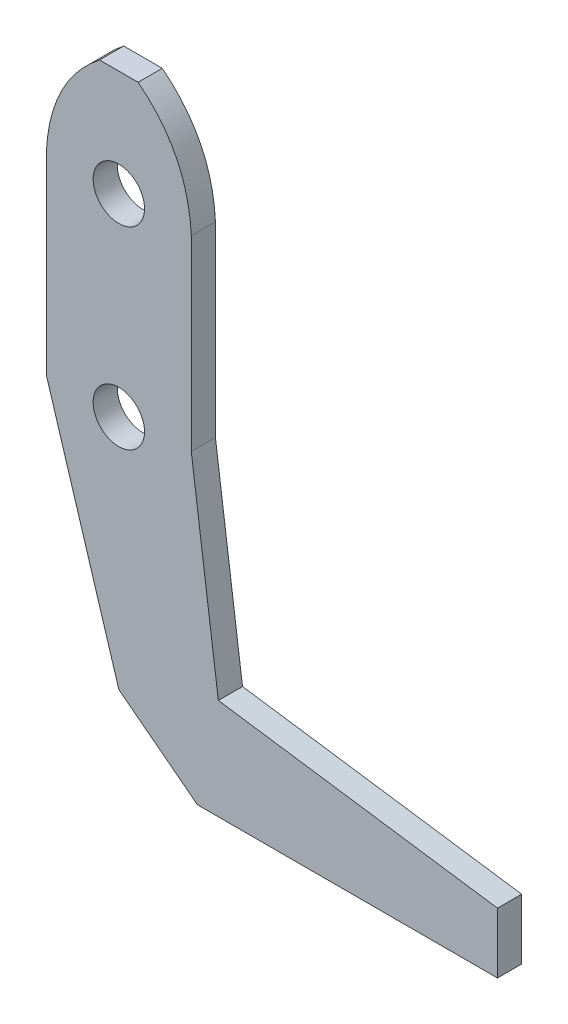
ISO-10303-21;
HEADER;
FILE_DESCRIPTION(('STEP AP214'),'2;1');
FILE_NAME('part.step','',(''),(''),'','','');
FILE_SCHEMA(('AUTOMOTIVE_DESIGN { 1 0 10303 214 1 1 1 1 }'));
ENDSEC;
DATA;
#1=APPLICATION_CONTEXT('core data for automotive mechanical design processes');
#2=APPLICATION_PROTOCOL_DEFINITION('international standard','automotive_design',2000,#1);
#3=PRODUCT_CONTEXT('',#1,'mechanical');
#4=PRODUCT('Part','Part','',(#3));
#5=PRODUCT_RELATED_PRODUCT_CATEGORY('part','',(#4));
#6=PRODUCT_DEFINITION_FORMATION('','',#4);
#7=PRODUCT_DEFINITION_CONTEXT('part definition',#1,'design');
#8=PRODUCT_DEFINITION('design','',#6,#7);
#9=PRODUCT_DEFINITION_SHAPE('','',#8);
#10=(LENGTH_UNIT() NAMED_UNIT(*) SI_UNIT(.MILLI.,.METRE.));
#11=(NAMED_UNIT(*) PLANE_ANGLE_UNIT() SI_UNIT($,.RADIAN.));
#12=(NAMED_UNIT(*) SI_UNIT($,.STERADIAN.) SOLID_ANGLE_UNIT());
#13=UNCERTAINTY_MEASURE_WITH_UNIT(LENGTH_MEASURE(1.E-05),#10,'distance_accuracy_value','');
#14=(GEOMETRIC_REPRESENTATION_CONTEXT(3) GLOBAL_UNCERTAINTY_ASSIGNED_CONTEXT((#13)) GLOBAL_UNIT_ASSIGNED_CONTEXT((#10,
#11,#12)) REPRESENTATION_CONTEXT('',''));
#15=CARTESIAN_POINT('',(0.,0.,0.));
#16=DIRECTION('',(0.,0.,1.));
#17=DIRECTION('',(1.,0.,0.));
#18=AXIS2_PLACEMENT_3D('',#15,#16,#17);
#19=CARTESIAN_POINT('',(7.56395945773196,33.2933187603989,3.175));
#20=DIRECTION('',(0.,0.,1.));
#21=DIRECTION('',(1.,0.,0.));
#22=AXIS2_PLACEMENT_3D('',#19,#20,#21);
#23=PLANE('',#22);
#24=CARTESIAN_POINT('',(0.,25.4,3.175));
#25=DIRECTION('',(0.,0.,1.));
#26=DIRECTION('',(1.,0.,0.));
#27=AXIS2_PLACEMENT_3D('',#24,#25,#26);
#28=CIRCLE('',#27,3.3782);
#29=CARTESIAN_POINT('',(3.3782,25.4,3.175));
#30=VERTEX_POINT('',#29);
#31=EDGE_CURVE('E159',#30,#30,#28,.T.);
#32=ORIENTED_EDGE('',*,*,#31,.F.);
#33=EDGE_LOOP('',(#32));
#34=FACE_BOUND('',#33,.T.);
#35=DIRECTION('',(0.792396539647466,-0.610006331077574,0.));
#36=VECTOR('',#35,1.);
#37=CARTESIAN_POINT('',(0.,-31.025635148862,3.175));
#38=LINE('',#37,#36);
#39=CARTESIAN_POINT('',(0.,-31.025635148862,3.175));
#40=VERTEX_POINT('',#39);
#41=CARTESIAN_POINT('',(10.326960052589,-38.9755828047,3.175));
#42=VERTEX_POINT('',#41);
#43=EDGE_CURVE('E186',#40,#42,#38,.T.);
#44=ORIENTED_EDGE('',*,*,#43,.T.);
#45=DIRECTION('',(1.,0.,0.));
#46=VECTOR('',#45,1.);
#47=CARTESIAN_POINT('',(10.326960052589,-38.9755828047,3.175));
#48=LINE('',#47,#46);
#49=CARTESIAN_POINT('',(49.7727794760482,-38.9755828047,3.175));
#50=VERTEX_POINT('',#49);
#51=EDGE_CURVE('E106',#42,#50,#48,.T.);
#52=ORIENTED_EDGE('',*,*,#51,.T.);
#53=DIRECTION('',(0.,1.,0.));
#54=VECTOR('',#53,1.);
#55=CARTESIAN_POINT('',(49.7727794760482,-38.9755828047,3.175));
#56=LINE('',#55,#54);
#57=CARTESIAN_POINT('',(49.7727794760482,-31.025635148862,3.175));
#58=VERTEX_POINT('',#57);
#59=EDGE_CURVE('E210',#50,#58,#56,.T.);
#60=ORIENTED_EDGE('',*,*,#59,.T.);
#61=DIRECTION('',(-0.989728356843954,0.142960762655238,0.));
#62=VECTOR('',#61,1.);
#63=CARTESIAN_POINT('',(49.7727794760482,-31.025635148862,3.175));
#64=LINE('',#63,#62);
#65=CARTESIAN_POINT('',(13.0807133721805,-25.72567004497,3.175));
#66=VERTEX_POINT('',#65);
#67=EDGE_CURVE('E229',#58,#66,#64,.T.);
#68=ORIENTED_EDGE('',*,*,#67,.T.);
#69=DIRECTION('',(-0.132697105302083,0.99115663658397,0.));
#70=VECTOR('',#69,1.);
#71=CARTESIAN_POINT('',(13.0807133721805,-25.72567004497,3.175));
#72=LINE('',#71,#70);
#73=CARTESIAN_POINT('',(9.52500000000001,0.833077401736659,3.175));
#74=VERTEX_POINT('',#73);
#75=EDGE_CURVE('E226',#66,#74,#72,.T.);
#76=ORIENTED_EDGE('',*,*,#75,.T.);
#77=DIRECTION('',(0.,1.,0.));
#78=VECTOR('',#77,1.);
#79=CARTESIAN_POINT('',(9.525,25.4,3.175));
#80=LINE('',#79,#78);
#81=CARTESIAN_POINT('',(9.525,25.4,3.175));
#82=VERTEX_POINT('',#81);
#83=EDGE_CURVE('E228',#74,#82,#80,.T.);
#84=ORIENTED_EDGE('',*,*,#83,.T.);
#85=CARTESIAN_POINT('',(9.525,25.4,3.175));
#86=CARTESIAN_POINT('',(9.09541891546392,34.2016375207979,3.175));
#87=CARTESIAN_POINT('',(2.54,39.37,3.175));
#88=B_SPLINE_CURVE_WITH_KNOTS('',2,(#85,#86,#87),.UNSPECIFIED.,.F.,.F.,(3,3),(0.,1.),.UNSPECIFIED.);
#89=CARTESIAN_POINT('',(2.54,39.37,3.175));
#90=VERTEX_POINT('',#89);
#91=EDGE_CURVE('E231',#82,#90,#88,.T.);
#92=ORIENTED_EDGE('',*,*,#91,.T.);
#93=DIRECTION('',(-1.,0.,0.));
#94=VECTOR('',#93,1.);
#95=CARTESIAN_POINT('',(-2.54,39.37,3.175));
#96=LINE('',#95,#94);
#97=CARTESIAN_POINT('',(-2.54,39.37,3.175));
#98=VERTEX_POINT('',#97);
#99=EDGE_CURVE('E134',#90,#98,#96,.T.);
#100=ORIENTED_EDGE('',*,*,#99,.T.);
#101=CARTESIAN_POINT('',(-2.54,39.37,3.175));
#102=CARTESIAN_POINT('',(-9.09541891546392,34.2016375207979,3.175));
#103=CARTESIAN_POINT('',(-9.525,25.4,3.175));
#104=B_SPLINE_CURVE_WITH_KNOTS('',2,(#101,#102,#103),.UNSPECIFIED.,.F.,.F.,(3,3),(0.,1.),.UNSPECIFIED.);
#105=CARTESIAN_POINT('',(-9.525,25.4,3.175));
#106=VERTEX_POINT('',#105);
#107=EDGE_CURVE('E128',#98,#106,#104,.T.);
#108=ORIENTED_EDGE('',*,*,#107,.T.);
#109=DIRECTION('',(0.,-1.,0.));
#110=VECTOR('',#109,1.);
#111=CARTESIAN_POINT('',(-9.525,25.4,3.175));
#112=LINE('',#111,#110);
#113=CARTESIAN_POINT('',(-9.525,0.,3.175));
#114=VERTEX_POINT('',#113);
#115=EDGE_CURVE('E132',#106,#114,#112,.T.);
#116=ORIENTED_EDGE('',*,*,#115,.T.);
#117=DIRECTION('',(0.293484867653749,-0.95596371921651,0.));
#118=VECTOR('',#117,1.);
#119=CARTESIAN_POINT('',(-9.525,0.,3.175));
#120=LINE('',#119,#118);
#121=EDGE_CURVE('E54',#114,#40,#120,.T.);
#122=ORIENTED_EDGE('',*,*,#121,.T.);
#123=EDGE_LOOP('',(#44,#52,#60,#68,#76,#84,#92,#100,#108,#116,#122));
#124=FACE_BOUND('',#123,.T.);
#125=CARTESIAN_POINT('',(0.,0.,3.175));
#126=DIRECTION('',(0.,0.,1.));
#127=DIRECTION('',(1.,0.,0.));
#128=AXIS2_PLACEMENT_3D('',#125,#126,#127);
#129=CIRCLE('',#128,3.3782);
#130=CARTESIAN_POINT('',(3.3782,0.,3.175));
#131=VERTEX_POINT('',#130);
#132=EDGE_CURVE('E299',#131,#131,#129,.T.);
#133=ORIENTED_EDGE('',*,*,#132,.F.);
#134=EDGE_LOOP('',(#133));
#135=FACE_BOUND('',#134,.T.);
#136=ADVANCED_FACE('F37',(#34,#124,#135),#23,.T.);
#137=CARTESIAN_POINT('',(7.56395945773196,33.2933187603989,0.));
#138=DIRECTION('',(0.,0.,1.));
#139=DIRECTION('',(1.,0.,0.));
#140=AXIS2_PLACEMENT_3D('',#137,#138,#139);
#141=PLANE('',#140);
#142=DIRECTION('',(0.792396539647466,-0.610006331077574,0.));
#143=VECTOR('',#142,1.);
#144=CARTESIAN_POINT('',(0.,-31.025635148862,0.));
#145=LINE('',#144,#143);
#146=CARTESIAN_POINT('',(0.,-31.025635148862,0.));
#147=VERTEX_POINT('',#146);
#148=CARTESIAN_POINT('',(10.326960052589,-38.9755828047,0.));
#149=VERTEX_POINT('',#148);
#150=EDGE_CURVE('E155',#147,#149,#145,.T.);
#151=ORIENTED_EDGE('',*,*,#150,.F.);
#152=DIRECTION('',(0.293484867653749,-0.95596371921651,0.));
#153=VECTOR('',#152,1.);
#154=CARTESIAN_POINT('',(-9.525,0.,0.));
#155=LINE('',#154,#153);
#156=CARTESIAN_POINT('',(-9.525,0.,0.));
#157=VERTEX_POINT('',#156);
#158=EDGE_CURVE('E98',#157,#147,#155,.T.);
#159=ORIENTED_EDGE('',*,*,#158,.F.);
#160=DIRECTION('',(0.,-1.,0.));
#161=VECTOR('',#160,1.);
#162=CARTESIAN_POINT('',(-9.525,25.4,0.));
#163=LINE('',#162,#161);
#164=CARTESIAN_POINT('',(-9.525,25.4,0.));
#165=VERTEX_POINT('',#164);
#166=EDGE_CURVE('E92',#165,#157,#163,.T.);
#167=ORIENTED_EDGE('',*,*,#166,.F.);
#168=CARTESIAN_POINT('',(-2.54,39.37,0.));
#169=CARTESIAN_POINT('',(-9.09541891546392,34.2016375207979,0.));
#170=CARTESIAN_POINT('',(-9.525,25.4,0.));
#171=B_SPLINE_CURVE_WITH_KNOTS('',2,(#168,#169,#170),.UNSPECIFIED.,.F.,.F.,(3,3),(0.,1.),.UNSPECIFIED.);
#172=CARTESIAN_POINT('',(-2.54,39.37,0.));
#173=VERTEX_POINT('',#172);
#174=EDGE_CURVE('E142',#173,#165,#171,.T.);
#175=ORIENTED_EDGE('',*,*,#174,.F.);
#176=DIRECTION('',(-1.,0.,0.));
#177=VECTOR('',#176,1.);
#178=CARTESIAN_POINT('',(-2.54,39.37,0.));
#179=LINE('',#178,#177);
#180=CARTESIAN_POINT('',(2.54,39.37,0.));
#181=VERTEX_POINT('',#180);
#182=EDGE_CURVE('E173',#181,#173,#179,.T.);
#183=ORIENTED_EDGE('',*,*,#182,.F.);
#184=CARTESIAN_POINT('',(9.525,25.4,0.));
#185=CARTESIAN_POINT('',(9.09541891546392,34.2016375207979,0.));
#186=CARTESIAN_POINT('',(2.54,39.37,0.));
#187=B_SPLINE_CURVE_WITH_KNOTS('',2,(#184,#185,#186),.UNSPECIFIED.,.F.,.F.,(3,3),(0.,1.),.UNSPECIFIED.);
#188=CARTESIAN_POINT('',(9.525,25.4,0.));
#189=VERTEX_POINT('',#188);
#190=EDGE_CURVE('E169',#189,#181,#187,.T.);
#191=ORIENTED_EDGE('',*,*,#190,.F.);
#192=DIRECTION('',(0.,1.,0.));
#193=VECTOR('',#192,1.);
#194=CARTESIAN_POINT('',(9.525,25.4,0.));
#195=LINE('',#194,#193);
#196=CARTESIAN_POINT('',(9.52500000000001,0.833077401736659,0.));
#197=VERTEX_POINT('',#196);
#198=EDGE_CURVE('E167',#197,#189,#195,.T.);
#199=ORIENTED_EDGE('',*,*,#198,.F.);
#200=DIRECTION('',(-0.132697105302083,0.99115663658397,0.));
#201=VECTOR('',#200,1.);
#202=CARTESIAN_POINT('',(13.0807133721805,-25.72567004497,0.));
#203=LINE('',#202,#201);
#204=CARTESIAN_POINT('',(13.0807133721805,-25.72567004497,0.));
#205=VERTEX_POINT('',#204);
#206=EDGE_CURVE('E165',#205,#197,#203,.T.);
#207=ORIENTED_EDGE('',*,*,#206,.F.);
#208=DIRECTION('',(-0.989728356843954,0.142960762655238,0.));
#209=VECTOR('',#208,1.);
#210=CARTESIAN_POINT('',(49.7727794760482,-31.025635148862,0.));
#211=LINE('',#210,#209);
#212=CARTESIAN_POINT('',(49.7727794760482,-31.025635148862,0.));
#213=VERTEX_POINT('',#212);
#214=EDGE_CURVE('E163',#213,#205,#211,.T.);
#215=ORIENTED_EDGE('',*,*,#214,.F.);
#216=DIRECTION('',(0.,1.,0.));
#217=VECTOR('',#216,1.);
#218=CARTESIAN_POINT('',(49.7727794760482,-38.9755828047,0.));
#219=LINE('',#218,#217);
#220=CARTESIAN_POINT('',(49.7727794760482,-38.9755828047,0.));
#221=VERTEX_POINT('',#220);
#222=EDGE_CURVE('E161',#221,#213,#219,.T.);
#223=ORIENTED_EDGE('',*,*,#222,.F.);
#224=DIRECTION('',(1.,0.,0.));
#225=VECTOR('',#224,1.);
#226=CARTESIAN_POINT('',(10.326960052589,-38.9755828047,0.));
#227=LINE('',#226,#225);
#228=EDGE_CURVE('E158',#149,#221,#227,.T.);
#229=ORIENTED_EDGE('',*,*,#228,.F.);
#230=EDGE_LOOP('',(#151,#159,#167,#175,#183,#191,#199,#207,#215,#223,#229));
#231=FACE_BOUND('',#230,.T.);
#232=CARTESIAN_POINT('',(0.,25.4,0.));
#233=DIRECTION('',(0.,0.,1.));
#234=DIRECTION('',(1.,0.,0.));
#235=AXIS2_PLACEMENT_3D('',#232,#233,#234);
#236=CIRCLE('',#235,3.3782);
#237=CARTESIAN_POINT('',(3.3782,25.4,0.));
#238=VERTEX_POINT('',#237);
#239=EDGE_CURVE('E296',#238,#238,#236,.T.);
#240=ORIENTED_EDGE('',*,*,#239,.T.);
#241=EDGE_LOOP('',(#240));
#242=FACE_BOUND('',#241,.T.);
#243=CARTESIAN_POINT('',(0.,0.,0.));
#244=DIRECTION('',(0.,0.,1.));
#245=DIRECTION('',(1.,0.,0.));
#246=AXIS2_PLACEMENT_3D('',#243,#244,#245);
#247=CIRCLE('',#246,3.3782);
#248=CARTESIAN_POINT('',(3.3782,0.,0.));
#249=VERTEX_POINT('',#248);
#250=EDGE_CURVE('E302',#249,#249,#247,.T.);
#251=ORIENTED_EDGE('',*,*,#250,.T.);
#252=EDGE_LOOP('',(#251));
#253=FACE_BOUND('',#252,.T.);
#254=ADVANCED_FACE('F214',(#231,#242,#253),#141,.F.);
#255=CARTESIAN_POINT('',(0.,-31.025635148862,3.175));
#256=DIRECTION('',(0.610006331077574,0.792396539647466,0.));
#257=DIRECTION('',(-0.792396539647466,0.610006331077574,0.));
#258=AXIS2_PLACEMENT_3D('',#255,#256,#257);
#259=PLANE('',#258);
#260=ORIENTED_EDGE('',*,*,#150,.T.);
#261=DIRECTION('',(0.,0.,-1.));
#262=VECTOR('',#261,1.);
#263=CARTESIAN_POINT('',(10.326960052589,-38.9755828047,3.175));
#264=LINE('',#263,#262);
#265=EDGE_CURVE('E11',#42,#149,#264,.T.);
#266=ORIENTED_EDGE('',*,*,#265,.F.);
#267=ORIENTED_EDGE('',*,*,#43,.F.);
#268=DIRECTION('',(0.,0.,-1.));
#269=VECTOR('',#268,1.);
#270=CARTESIAN_POINT('',(0.,-31.025635148862,3.175));
#271=LINE('',#270,#269);
#272=EDGE_CURVE('E148',#40,#147,#271,.T.);
#273=ORIENTED_EDGE('',*,*,#272,.T.);
#274=EDGE_LOOP('',(#260,#266,#267,#273));
#275=FACE_BOUND('',#274,.T.);
#276=ADVANCED_FACE('F39',(#275),#259,.F.);
#277=CARTESIAN_POINT('',(10.326960052589,-38.9755828047,3.175));
#278=DIRECTION('',(0.,1.,0.));
#279=DIRECTION('',(0.,0.,1.));
#280=AXIS2_PLACEMENT_3D('',#277,#278,#279);
#281=PLANE('',#280);
#282=ORIENTED_EDGE('',*,*,#228,.T.);
#283=DIRECTION('',(0.,0.,-1.));
#284=VECTOR('',#283,1.);
#285=CARTESIAN_POINT('',(49.7727794760482,-38.9755828047,3.175));
#286=LINE('',#285,#284);
#287=EDGE_CURVE('E46',#50,#221,#286,.T.);
#288=ORIENTED_EDGE('',*,*,#287,.F.);
#289=ORIENTED_EDGE('',*,*,#51,.F.);
#290=ORIENTED_EDGE('',*,*,#265,.T.);
#291=EDGE_LOOP('',(#282,#288,#289,#290));
#292=FACE_BOUND('',#291,.T.);
#293=ADVANCED_FACE('F259',(#292),#281,.F.);
#294=CARTESIAN_POINT('',(49.7727794760482,-38.9755828047,3.175));
#295=DIRECTION('',(-1.,0.,0.));
#296=DIRECTION('',(0.,0.,1.));
#297=AXIS2_PLACEMENT_3D('',#294,#295,#296);
#298=PLANE('',#297);
#299=ORIENTED_EDGE('',*,*,#222,.T.);
#300=DIRECTION('',(0.,0.,-1.));
#301=VECTOR('',#300,1.);
#302=CARTESIAN_POINT('',(49.7727794760482,-31.025635148862,3.175));
#303=LINE('',#302,#301);
#304=EDGE_CURVE('E202',#58,#213,#303,.T.);
#305=ORIENTED_EDGE('',*,*,#304,.F.);
#306=ORIENTED_EDGE('',*,*,#59,.F.);
#307=ORIENTED_EDGE('',*,*,#287,.T.);
#308=EDGE_LOOP('',(#299,#305,#306,#307));
#309=FACE_BOUND('',#308,.T.);
#310=ADVANCED_FACE('F208',(#309),#298,.F.);
#311=CARTESIAN_POINT('',(49.7727794760482,-31.025635148862,3.175));
#312=DIRECTION('',(-0.142960762655238,-0.989728356843954,0.));
#313=DIRECTION('',(0.989728356843954,-0.142960762655238,0.));
#314=AXIS2_PLACEMENT_3D('',#311,#312,#313);
#315=PLANE('',#314);
#316=ORIENTED_EDGE('',*,*,#214,.T.);
#317=DIRECTION('',(0.,0.,-1.));
#318=VECTOR('',#317,1.);
#319=CARTESIAN_POINT('',(13.0807133721805,-25.72567004497,3.175));
#320=LINE('',#319,#318);
#321=EDGE_CURVE('E199',#66,#205,#320,.T.);
#322=ORIENTED_EDGE('',*,*,#321,.F.);
#323=ORIENTED_EDGE('',*,*,#67,.F.);
#324=ORIENTED_EDGE('',*,*,#304,.T.);
#325=EDGE_LOOP('',(#316,#322,#323,#324));
#326=FACE_BOUND('',#325,.T.);
#327=ADVANCED_FACE('F220',(#326),#315,.F.);
#328=CARTESIAN_POINT('',(13.0807133721805,-25.72567004497,3.175));
#329=DIRECTION('',(-0.99115663658397,-0.132697105302083,0.));
#330=DIRECTION('',(0.132697105302083,-0.99115663658397,0.));
#331=AXIS2_PLACEMENT_3D('',#328,#329,#330);
#332=PLANE('',#331);
#333=ORIENTED_EDGE('',*,*,#206,.T.);
#334=DIRECTION('',(0.,0.,-1.));
#335=VECTOR('',#334,1.);
#336=CARTESIAN_POINT('',(9.52500000000001,0.833077401736659,3.175));
#337=LINE('',#336,#335);
#338=EDGE_CURVE('E196',#74,#197,#337,.T.);
#339=ORIENTED_EDGE('',*,*,#338,.F.);
#340=ORIENTED_EDGE('',*,*,#75,.F.);
#341=ORIENTED_EDGE('',*,*,#321,.T.);
#342=EDGE_LOOP('',(#333,#339,#340,#341));
#343=FACE_BOUND('',#342,.T.);
#344=ADVANCED_FACE('F224',(#343),#332,.F.);
#345=CARTESIAN_POINT('',(9.525,25.4,3.175));
#346=DIRECTION('',(-1.,0.,0.));
#347=DIRECTION('',(0.,-1.,0.));
#348=AXIS2_PLACEMENT_3D('',#345,#346,#347);
#349=PLANE('',#348);
#350=ORIENTED_EDGE('',*,*,#198,.T.);
#351=DIRECTION('',(0.,0.,-1.));
#352=VECTOR('',#351,1.);
#353=CARTESIAN_POINT('',(9.525,25.4,3.175));
#354=LINE('',#353,#352);
#355=EDGE_CURVE('E193',#82,#189,#354,.T.);
#356=ORIENTED_EDGE('',*,*,#355,.F.);
#357=ORIENTED_EDGE('',*,*,#83,.F.);
#358=ORIENTED_EDGE('',*,*,#338,.T.);
#359=EDGE_LOOP('',(#350,#356,#357,#358));
#360=FACE_BOUND('',#359,.T.);
#361=ADVANCED_FACE('F248',(#360),#349,.F.);
#362=DIRECTION('',(0.,0.,-1.));
#363=VECTOR('',#362,1.);
#364=SURFACE_OF_LINEAR_EXTRUSION('',#88,#363);
#365=ORIENTED_EDGE('',*,*,#190,.T.);
#366=DIRECTION('',(0.,0.,-1.));
#367=VECTOR('',#366,1.);
#368=CARTESIAN_POINT('',(2.54,39.37,3.175));
#369=LINE('',#368,#367);
#370=EDGE_CURVE('E190',#90,#181,#369,.T.);
#371=ORIENTED_EDGE('',*,*,#370,.F.);
#372=ORIENTED_EDGE('',*,*,#91,.F.);
#373=ORIENTED_EDGE('',*,*,#355,.T.);
#374=EDGE_LOOP('',(#365,#371,#372,#373));
#375=FACE_BOUND('',#374,.T.);
#376=ADVANCED_FACE('F243',(#375),#364,.F.);
#377=CARTESIAN_POINT('',(-2.54,39.37,3.175));
#378=DIRECTION('',(0.,-1.,0.));
#379=DIRECTION('',(0.,0.,-1.));
#380=AXIS2_PLACEMENT_3D('',#377,#378,#379);
#381=PLANE('',#380);
#382=ORIENTED_EDGE('',*,*,#182,.T.);
#383=DIRECTION('',(0.,0.,-1.));
#384=VECTOR('',#383,1.);
#385=CARTESIAN_POINT('',(-2.54,39.37,3.175));
#386=LINE('',#385,#384);
#387=EDGE_CURVE('E143',#98,#173,#386,.T.);
#388=ORIENTED_EDGE('',*,*,#387,.F.);
#389=ORIENTED_EDGE('',*,*,#99,.F.);
#390=ORIENTED_EDGE('',*,*,#370,.T.);
#391=EDGE_LOOP('',(#382,#388,#389,#390));
#392=FACE_BOUND('',#391,.T.);
#393=ADVANCED_FACE('F247',(#392),#381,.F.);
#394=DIRECTION('',(0.,0.,-1.));
#395=VECTOR('',#394,1.);
#396=SURFACE_OF_LINEAR_EXTRUSION('',#104,#395);
#397=ORIENTED_EDGE('',*,*,#174,.T.);
#398=DIRECTION('',(0.,0.,-1.));
#399=VECTOR('',#398,1.);
#400=CARTESIAN_POINT('',(-9.525,25.4,3.175));
#401=LINE('',#400,#399);
#402=EDGE_CURVE('E139',#106,#165,#401,.T.);
#403=ORIENTED_EDGE('',*,*,#402,.F.);
#404=ORIENTED_EDGE('',*,*,#107,.F.);
#405=ORIENTED_EDGE('',*,*,#387,.T.);
#406=EDGE_LOOP('',(#397,#403,#404,#405));
#407=FACE_BOUND('',#406,.T.);
#408=ADVANCED_FACE('F140',(#407),#396,.F.);
#409=CARTESIAN_POINT('',(-9.525,25.4,3.175));
#410=DIRECTION('',(1.,0.,0.));
#411=DIRECTION('',(0.,0.,-1.));
#412=AXIS2_PLACEMENT_3D('',#409,#410,#411);
#413=PLANE('',#412);
#414=ORIENTED_EDGE('',*,*,#166,.T.);
#415=DIRECTION('',(0.,0.,-1.));
#416=VECTOR('',#415,1.);
#417=CARTESIAN_POINT('',(-9.525,0.,3.175));
#418=LINE('',#417,#416);
#419=EDGE_CURVE('E144',#114,#157,#418,.T.);
#420=ORIENTED_EDGE('',*,*,#419,.F.);
#421=ORIENTED_EDGE('',*,*,#115,.F.);
#422=ORIENTED_EDGE('',*,*,#402,.T.);
#423=EDGE_LOOP('',(#414,#420,#421,#422));
#424=FACE_BOUND('',#423,.T.);
#425=ADVANCED_FACE('F146',(#424),#413,.F.);
#426=CARTESIAN_POINT('',(-9.525,0.,3.175));
#427=DIRECTION('',(0.95596371921651,0.293484867653749,0.));
#428=DIRECTION('',(-0.293484867653749,0.95596371921651,0.));
#429=AXIS2_PLACEMENT_3D('',#426,#427,#428);
#430=PLANE('',#429);
#431=ORIENTED_EDGE('',*,*,#158,.T.);
#432=ORIENTED_EDGE('',*,*,#272,.F.);
#433=ORIENTED_EDGE('',*,*,#121,.F.);
#434=ORIENTED_EDGE('',*,*,#419,.T.);
#435=EDGE_LOOP('',(#431,#432,#433,#434));
#436=FACE_BOUND('',#435,.T.);
#437=ADVANCED_FACE('F277',(#436),#430,.F.);
#438=CARTESIAN_POINT('',(0.,25.4,3.175));
#439=DIRECTION('',(0.,0.,-1.));
#440=DIRECTION('',(-1.,0.,0.));
#441=AXIS2_PLACEMENT_3D('',#438,#439,#440);
#442=CYLINDRICAL_SURFACE('',#441,3.3782);
#443=ORIENTED_EDGE('',*,*,#31,.T.);
#444=EDGE_LOOP('',(#443));
#445=FACE_BOUND('',#444,.T.);
#446=ORIENTED_EDGE('',*,*,#239,.F.);
#447=EDGE_LOOP('',(#446));
#448=FACE_BOUND('',#447,.T.);
#449=ADVANCED_FACE('F274',(#445,#448),#442,.F.);
#450=CARTESIAN_POINT('',(0.,0.,3.175));
#451=DIRECTION('',(0.,0.,-1.));
#452=DIRECTION('',(-1.,0.,0.));
#453=AXIS2_PLACEMENT_3D('',#450,#451,#452);
#454=CYLINDRICAL_SURFACE('',#453,3.3782);
#455=ORIENTED_EDGE('',*,*,#132,.T.);
#456=EDGE_LOOP('',(#455));
#457=FACE_BOUND('',#456,.T.);
#458=ORIENTED_EDGE('',*,*,#250,.F.);
#459=EDGE_LOOP('',(#458));
#460=FACE_BOUND('',#459,.T.);
#461=ADVANCED_FACE('F308',(#457,#460),#454,.F.);
#462=CLOSED_SHELL('',(#136,#254,#276,#293,#310,#327,#344,#361,#376,#393,#408,#425,#437,#449,#461));
#463=MANIFOLD_SOLID_BREP('B2',#462);
#464=ADVANCED_BREP_SHAPE_REPRESENTATION('',(#18,#463),#14);
#465=SHAPE_DEFINITION_REPRESENTATION(#9,#464);
ENDSEC;
END-ISO-10303-21;
